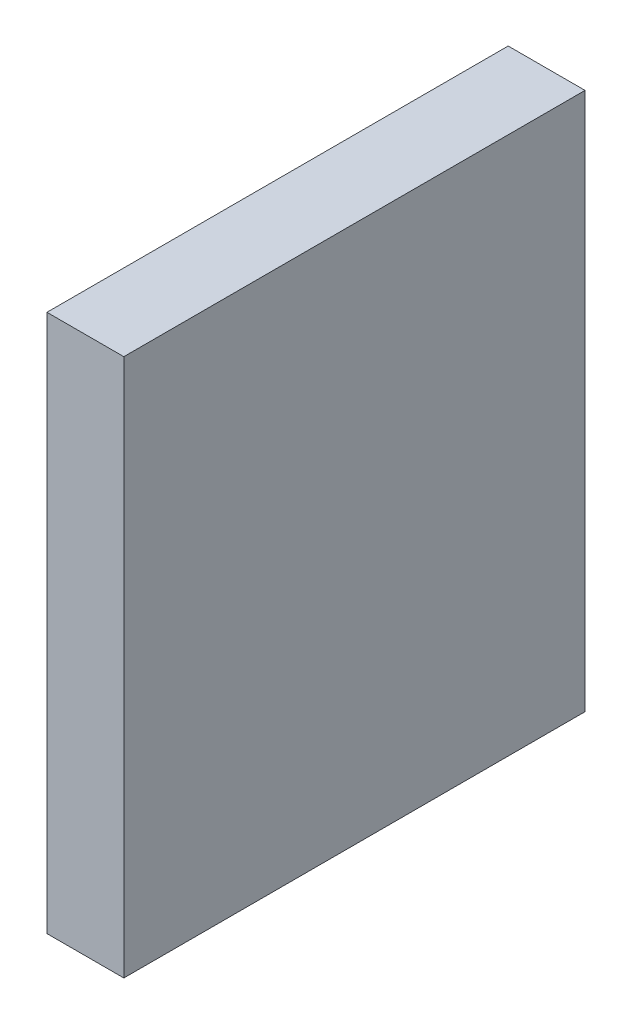
ISO-10303-21;
HEADER;
FILE_DESCRIPTION(('STEP AP214'),'2;1');
FILE_NAME('part.step','',(''),(''),'','','');
FILE_SCHEMA(('AUTOMOTIVE_DESIGN { 1 0 10303 214 1 1 1 1 }'));
ENDSEC;
DATA;
#1=APPLICATION_CONTEXT('core data for automotive mechanical design processes');
#2=APPLICATION_PROTOCOL_DEFINITION('international standard','automotive_design',2000,#1);
#3=PRODUCT_CONTEXT('',#1,'mechanical');
#4=PRODUCT('Part','Part','',(#3));
#5=PRODUCT_RELATED_PRODUCT_CATEGORY('part','',(#4));
#6=PRODUCT_DEFINITION_FORMATION('','',#4);
#7=PRODUCT_DEFINITION_CONTEXT('part definition',#1,'design');
#8=PRODUCT_DEFINITION('design','',#6,#7);
#9=PRODUCT_DEFINITION_SHAPE('','',#8);
#10=(LENGTH_UNIT() NAMED_UNIT(*) SI_UNIT(.MILLI.,.METRE.));
#11=(NAMED_UNIT(*) PLANE_ANGLE_UNIT() SI_UNIT($,.RADIAN.));
#12=(NAMED_UNIT(*) SI_UNIT($,.STERADIAN.) SOLID_ANGLE_UNIT());
#13=UNCERTAINTY_MEASURE_WITH_UNIT(LENGTH_MEASURE(1.E-05),#10,'distance_accuracy_value','');
#14=(GEOMETRIC_REPRESENTATION_CONTEXT(3) GLOBAL_UNCERTAINTY_ASSIGNED_CONTEXT((#13)) GLOBAL_UNIT_ASSIGNED_CONTEXT((#10,
#11,#12)) REPRESENTATION_CONTEXT('',''));
#15=CARTESIAN_POINT('',(0.,0.,0.));
#16=DIRECTION('',(0.,0.,1.));
#17=DIRECTION('',(1.,0.,0.));
#18=AXIS2_PLACEMENT_3D('',#15,#16,#17);
#19=CARTESIAN_POINT('',(24.1,1.87,15.16));
#20=DIRECTION('',(-1.,0.,0.));
#21=DIRECTION('',(0.,0.,1.));
#22=AXIS2_PLACEMENT_3D('',#19,#20,#21);
#23=PLANE('',#22);
#24=DIRECTION('',(0.,0.,1.));
#25=VECTOR('',#24,1.);
#26=CARTESIAN_POINT('',(24.1,2.22,15.46));
#27=LINE('',#26,#25);
#28=CARTESIAN_POINT('',(24.1,2.22,15.46));
#29=VERTEX_POINT('',#28);
#30=CARTESIAN_POINT('',(24.1,2.22,14.86));
#31=VERTEX_POINT('',#30);
#32=EDGE_CURVE('E79',#29,#31,#27,.F.);
#33=ORIENTED_EDGE('',*,*,#32,.F.);
#34=DIRECTION('',(0.,1.,0.));
#35=VECTOR('',#34,1.);
#36=CARTESIAN_POINT('',(24.1,1.52,15.46));
#37=LINE('',#36,#35);
#38=CARTESIAN_POINT('',(24.1,1.52,15.46));
#39=VERTEX_POINT('',#38);
#40=EDGE_CURVE('E55',#39,#29,#37,.T.);
#41=ORIENTED_EDGE('',*,*,#40,.F.);
#42=DIRECTION('',(0.,0.,-1.));
#43=VECTOR('',#42,1.);
#44=CARTESIAN_POINT('',(24.1,1.52,14.86));
#45=LINE('',#44,#43);
#46=CARTESIAN_POINT('',(24.1,1.52,14.86));
#47=VERTEX_POINT('',#46);
#48=EDGE_CURVE('E57',#47,#39,#45,.F.);
#49=ORIENTED_EDGE('',*,*,#48,.F.);
#50=DIRECTION('',(0.,1.,0.));
#51=VECTOR('',#50,1.);
#52=CARTESIAN_POINT('',(24.1,2.22,14.86));
#53=LINE('',#52,#51);
#54=EDGE_CURVE('E20',#31,#47,#53,.F.);
#55=ORIENTED_EDGE('',*,*,#54,.F.);
#56=EDGE_LOOP('',(#33,#41,#49,#55));
#57=FACE_BOUND('',#56,.T.);
#58=ADVANCED_FACE('F17',(#57),#23,.F.);
#59=CARTESIAN_POINT('',(24.1,2.22,14.86));
#60=DIRECTION('',(0.,0.,-1.));
#61=DIRECTION('',(-1.,0.,0.));
#62=AXIS2_PLACEMENT_3D('',#59,#60,#61);
#63=PLANE('',#62);
#64=DIRECTION('',(0.,1.,0.));
#65=VECTOR('',#64,1.);
#66=CARTESIAN_POINT('',(24.,1.87,14.86));
#67=LINE('',#66,#65);
#68=CARTESIAN_POINT('',(24.,2.22,14.86));
#69=VERTEX_POINT('',#68);
#70=CARTESIAN_POINT('',(24.,1.52,14.86));
#71=VERTEX_POINT('',#70);
#72=EDGE_CURVE('E83',#69,#71,#67,.F.);
#73=ORIENTED_EDGE('',*,*,#72,.F.);
#74=DIRECTION('',(1.,0.,0.));
#75=VECTOR('',#74,1.);
#76=CARTESIAN_POINT('',(24.1,2.22,14.86));
#77=LINE('',#76,#75);
#78=EDGE_CURVE('E68',#31,#69,#77,.F.);
#79=ORIENTED_EDGE('',*,*,#78,.F.);
#80=ORIENTED_EDGE('',*,*,#54,.T.);
#81=DIRECTION('',(1.,0.,0.));
#82=VECTOR('',#81,1.);
#83=CARTESIAN_POINT('',(24.1,1.52,14.86));
#84=LINE('',#83,#82);
#85=EDGE_CURVE('E63',#71,#47,#84,.T.);
#86=ORIENTED_EDGE('',*,*,#85,.F.);
#87=EDGE_LOOP('',(#73,#79,#80,#86));
#88=FACE_BOUND('',#87,.T.);
#89=ADVANCED_FACE('F65',(#88),#63,.T.);
#90=CARTESIAN_POINT('',(24.1,1.52,14.86));
#91=DIRECTION('',(0.,-1.,0.));
#92=DIRECTION('',(0.,0.,-1.));
#93=AXIS2_PLACEMENT_3D('',#90,#91,#92);
#94=PLANE('',#93);
#95=DIRECTION('',(0.,0.,1.));
#96=VECTOR('',#95,1.);
#97=CARTESIAN_POINT('',(24.,1.52,15.16));
#98=LINE('',#97,#96);
#99=CARTESIAN_POINT('',(24.,1.52,15.46));
#100=VERTEX_POINT('',#99);
#101=EDGE_CURVE('E72',#71,#100,#98,.T.);
#102=ORIENTED_EDGE('',*,*,#101,.F.);
#103=ORIENTED_EDGE('',*,*,#85,.T.);
#104=ORIENTED_EDGE('',*,*,#48,.T.);
#105=DIRECTION('',(1.,0.,0.));
#106=VECTOR('',#105,1.);
#107=CARTESIAN_POINT('',(24.1,1.52,15.46));
#108=LINE('',#107,#106);
#109=EDGE_CURVE('E75',#100,#39,#108,.T.);
#110=ORIENTED_EDGE('',*,*,#109,.F.);
#111=EDGE_LOOP('',(#102,#103,#104,#110));
#112=FACE_BOUND('',#111,.T.);
#113=ADVANCED_FACE('F70',(#112),#94,.T.);
#114=CARTESIAN_POINT('',(24.1,1.52,15.46));
#115=DIRECTION('',(0.,0.,1.));
#116=DIRECTION('',(1.,0.,0.));
#117=AXIS2_PLACEMENT_3D('',#114,#115,#116);
#118=PLANE('',#117);
#119=DIRECTION('',(0.,1.,0.));
#120=VECTOR('',#119,1.);
#121=CARTESIAN_POINT('',(24.,1.87,15.46));
#122=LINE('',#121,#120);
#123=CARTESIAN_POINT('',(24.,2.22,15.46));
#124=VERTEX_POINT('',#123);
#125=EDGE_CURVE('E26',#100,#124,#122,.T.);
#126=ORIENTED_EDGE('',*,*,#125,.F.);
#127=ORIENTED_EDGE('',*,*,#109,.T.);
#128=ORIENTED_EDGE('',*,*,#40,.T.);
#129=DIRECTION('',(1.,0.,0.));
#130=VECTOR('',#129,1.);
#131=CARTESIAN_POINT('',(24.1,2.22,15.46));
#132=LINE('',#131,#130);
#133=EDGE_CURVE('E35',#124,#29,#132,.T.);
#134=ORIENTED_EDGE('',*,*,#133,.F.);
#135=EDGE_LOOP('',(#126,#127,#128,#134));
#136=FACE_BOUND('',#135,.T.);
#137=ADVANCED_FACE('F89',(#136),#118,.T.);
#138=CARTESIAN_POINT('',(24.1,2.22,15.46));
#139=DIRECTION('',(0.,1.,0.));
#140=DIRECTION('',(0.,0.,1.));
#141=AXIS2_PLACEMENT_3D('',#138,#139,#140);
#142=PLANE('',#141);
#143=DIRECTION('',(0.,0.,1.));
#144=VECTOR('',#143,1.);
#145=CARTESIAN_POINT('',(24.,2.22,15.16));
#146=LINE('',#145,#144);
#147=EDGE_CURVE('E11',#124,#69,#146,.F.);
#148=ORIENTED_EDGE('',*,*,#147,.F.);
#149=ORIENTED_EDGE('',*,*,#133,.T.);
#150=ORIENTED_EDGE('',*,*,#32,.T.);
#151=ORIENTED_EDGE('',*,*,#78,.T.);
#152=EDGE_LOOP('',(#148,#149,#150,#151));
#153=FACE_BOUND('',#152,.T.);
#154=ADVANCED_FACE('F91',(#153),#142,.T.);
#155=CARTESIAN_POINT('',(24.,1.87,15.16));
#156=DIRECTION('',(-1.,0.,0.));
#157=DIRECTION('',(0.,0.,1.));
#158=AXIS2_PLACEMENT_3D('',#155,#156,#157);
#159=PLANE('',#158);
#160=ORIENTED_EDGE('',*,*,#125,.T.);
#161=ORIENTED_EDGE('',*,*,#147,.T.);
#162=ORIENTED_EDGE('',*,*,#72,.T.);
#163=ORIENTED_EDGE('',*,*,#101,.T.);
#164=EDGE_LOOP('',(#160,#161,#162,#163));
#165=FACE_BOUND('',#164,.T.);
#166=ADVANCED_FACE('F88',(#165),#159,.T.);
#167=CLOSED_SHELL('',(#58,#89,#113,#137,#154,#166));
#168=MANIFOLD_SOLID_BREP('B1',#167);
#169=ADVANCED_BREP_SHAPE_REPRESENTATION('',(#18,#168),#14);
#170=SHAPE_DEFINITION_REPRESENTATION(#9,#169);
ENDSEC;
END-ISO-10303-21;
